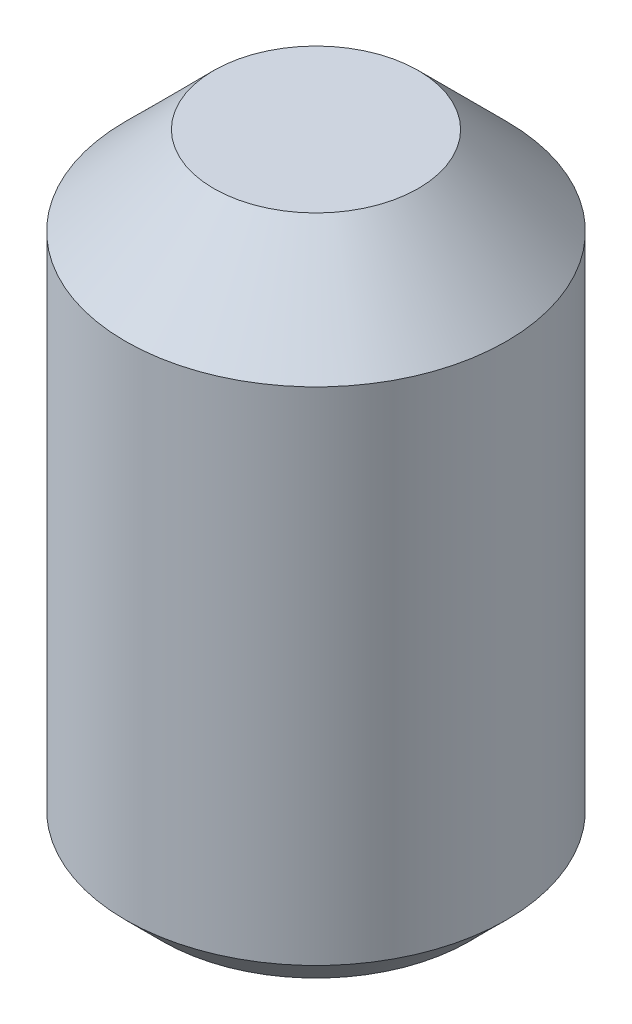
ISO-10303-21;
HEADER;
FILE_DESCRIPTION(('STEP AP214'),'2;1');
FILE_NAME('part.step','',(''),(''),'','','');
FILE_SCHEMA(('AUTOMOTIVE_DESIGN { 1 0 10303 214 1 1 1 1 }'));
ENDSEC;
DATA;
#1=APPLICATION_CONTEXT('core data for automotive mechanical design processes');
#2=APPLICATION_PROTOCOL_DEFINITION('international standard','automotive_design',2000,#1);
#3=PRODUCT_CONTEXT('',#1,'mechanical');
#4=PRODUCT('Part','Part','',(#3));
#5=PRODUCT_RELATED_PRODUCT_CATEGORY('part','',(#4));
#6=PRODUCT_DEFINITION_FORMATION('','',#4);
#7=PRODUCT_DEFINITION_CONTEXT('part definition',#1,'design');
#8=PRODUCT_DEFINITION('design','',#6,#7);
#9=PRODUCT_DEFINITION_SHAPE('','',#8);
#10=(LENGTH_UNIT() NAMED_UNIT(*) SI_UNIT(.MILLI.,.METRE.));
#11=(NAMED_UNIT(*) PLANE_ANGLE_UNIT() SI_UNIT($,.RADIAN.));
#12=(NAMED_UNIT(*) SI_UNIT($,.STERADIAN.) SOLID_ANGLE_UNIT());
#13=UNCERTAINTY_MEASURE_WITH_UNIT(LENGTH_MEASURE(1.E-05),#10,'distance_accuracy_value','');
#14=(GEOMETRIC_REPRESENTATION_CONTEXT(3) GLOBAL_UNCERTAINTY_ASSIGNED_CONTEXT((#13)) GLOBAL_UNIT_ASSIGNED_CONTEXT((#10,
#11,#12)) REPRESENTATION_CONTEXT('',''));
#15=CARTESIAN_POINT('',(0.,0.,0.));
#16=DIRECTION('',(0.,0.,1.));
#17=DIRECTION('',(1.,0.,0.));
#18=AXIS2_PLACEMENT_3D('',#15,#16,#17);
#19=CARTESIAN_POINT('',(0.68704079,0.,1.18998955515226));
#20=DIRECTION('',(0.,0.,1.));
#21=DIRECTION('',(1.,0.,0.));
#22=AXIS2_PLACEMENT_3D('',#19,#20,#21);
#23=PLANE('',#22);
#24=DIRECTION('',(0.,1.,0.));
#25=VECTOR('',#24,1.);
#26=CARTESIAN_POINT('',(-0.68704079,0.,1.18998955515226));
#27=LINE('',#26,#25);
#28=CARTESIAN_POINT('',(-0.68704079,0.,1.18998955515226));
#29=VERTEX_POINT('',#28);
#30=CARTESIAN_POINT('',(-0.68704079,2.54,1.18998955515226));
#31=VERTEX_POINT('',#30);
#32=EDGE_CURVE('E82',#29,#31,#27,.T.);
#33=ORIENTED_EDGE('',*,*,#32,.T.);
#34=DIRECTION('',(1.,0.,0.));
#35=VECTOR('',#34,1.);
#36=CARTESIAN_POINT('',(0.68704079,2.54,1.18998955515226));
#37=LINE('',#36,#35);
#38=CARTESIAN_POINT('',(0.68704079,2.54,1.18998955515226));
#39=VERTEX_POINT('',#38);
#40=EDGE_CURVE('E71',#39,#31,#37,.F.);
#41=ORIENTED_EDGE('',*,*,#40,.F.);
#42=DIRECTION('',(0.,1.,0.));
#43=VECTOR('',#42,1.);
#44=CARTESIAN_POINT('',(0.68704079,0.,1.18998955515226));
#45=LINE('',#44,#43);
#46=CARTESIAN_POINT('',(0.68704079,0.,1.18998955515226));
#47=VERTEX_POINT('',#46);
#48=EDGE_CURVE('E90',#39,#47,#45,.F.);
#49=ORIENTED_EDGE('',*,*,#48,.T.);
#50=DIRECTION('',(1.,0.,0.));
#51=VECTOR('',#50,1.);
#52=CARTESIAN_POINT('',(0.68704079,0.,1.18998955515226));
#53=LINE('',#52,#51);
#54=EDGE_CURVE('E66',#29,#47,#53,.T.);
#55=ORIENTED_EDGE('',*,*,#54,.F.);
#56=EDGE_LOOP('',(#33,#41,#49,#55));
#57=FACE_BOUND('',#56,.T.);
#58=ADVANCED_FACE('F16',(#57),#23,.F.);
#59=CARTESIAN_POINT('',(-0.68704079,0.,1.18998955515226));
#60=DIRECTION('',(-0.866025403784439,0.,0.5));
#61=DIRECTION('',(0.5,0.,0.866025403784439));
#62=AXIS2_PLACEMENT_3D('',#59,#60,#61);
#63=PLANE('',#62);
#64=DIRECTION('',(0.,1.,0.));
#65=VECTOR('',#64,1.);
#66=CARTESIAN_POINT('',(-1.37408158,0.,0.));
#67=LINE('',#66,#65);
#68=CARTESIAN_POINT('',(-1.37408158,0.,0.));
#69=VERTEX_POINT('',#68);
#70=CARTESIAN_POINT('',(-1.37408158,2.54,0.));
#71=VERTEX_POINT('',#70);
#72=EDGE_CURVE('E86',#69,#71,#67,.T.);
#73=ORIENTED_EDGE('',*,*,#72,.T.);
#74=DIRECTION('',(0.5,0.,0.866025403784439));
#75=VECTOR('',#74,1.);
#76=CARTESIAN_POINT('',(-0.68704079,2.54,1.18998955515226));
#77=LINE('',#76,#75);
#78=EDGE_CURVE('E75',#31,#71,#77,.F.);
#79=ORIENTED_EDGE('',*,*,#78,.F.);
#80=ORIENTED_EDGE('',*,*,#32,.F.);
#81=DIRECTION('',(0.5,0.,0.866025403784439));
#82=VECTOR('',#81,1.);
#83=CARTESIAN_POINT('',(-0.68704079,0.,1.18998955515226));
#84=LINE('',#83,#82);
#85=EDGE_CURVE('E88',#69,#29,#84,.T.);
#86=ORIENTED_EDGE('',*,*,#85,.F.);
#87=EDGE_LOOP('',(#73,#79,#80,#86));
#88=FACE_BOUND('',#87,.T.);
#89=ADVANCED_FACE('F85',(#88),#63,.F.);
#90=CARTESIAN_POINT('',(1.37408158,0.,0.));
#91=DIRECTION('',(0.866025403784439,0.,0.5));
#92=DIRECTION('',(0.5,0.,-0.866025403784439));
#93=AXIS2_PLACEMENT_3D('',#90,#91,#92);
#94=PLANE('',#93);
#95=ORIENTED_EDGE('',*,*,#48,.F.);
#96=DIRECTION('',(-0.5,0.,0.866025403784439));
#97=VECTOR('',#96,1.);
#98=CARTESIAN_POINT('',(1.37408158,2.54,0.));
#99=LINE('',#98,#97);
#100=CARTESIAN_POINT('',(1.37408158,2.54,0.));
#101=VERTEX_POINT('',#100);
#102=EDGE_CURVE('E78',#101,#39,#99,.T.);
#103=ORIENTED_EDGE('',*,*,#102,.F.);
#104=DIRECTION('',(0.,1.,0.));
#105=VECTOR('',#104,1.);
#106=CARTESIAN_POINT('',(1.37408158,0.,0.));
#107=LINE('',#106,#105);
#108=CARTESIAN_POINT('',(1.37408158,0.,0.));
#109=VERTEX_POINT('',#108);
#110=EDGE_CURVE('E121',#101,#109,#107,.F.);
#111=ORIENTED_EDGE('',*,*,#110,.T.);
#112=DIRECTION('',(0.5,0.,-0.866025403784439));
#113=VECTOR('',#112,1.);
#114=CARTESIAN_POINT('',(1.37408158,0.,0.));
#115=LINE('',#114,#113);
#116=EDGE_CURVE('E131',#47,#109,#115,.T.);
#117=ORIENTED_EDGE('',*,*,#116,.F.);
#118=EDGE_LOOP('',(#95,#103,#111,#117));
#119=FACE_BOUND('',#118,.T.);
#120=ADVANCED_FACE('F134',(#119),#94,.F.);
#121=CARTESIAN_POINT('',(-1.37408158,0.,0.));
#122=DIRECTION('',(-0.866025403784439,0.,-0.5));
#123=DIRECTION('',(-0.5,0.,0.866025403784439));
#124=AXIS2_PLACEMENT_3D('',#121,#122,#123);
#125=PLANE('',#124);
#126=DIRECTION('',(0.,1.,0.));
#127=VECTOR('',#126,1.);
#128=CARTESIAN_POINT('',(-0.68704079,0.,-1.18998955515226));
#129=LINE('',#128,#127);
#130=CARTESIAN_POINT('',(-0.68704079,0.,-1.18998955515226));
#131=VERTEX_POINT('',#130);
#132=CARTESIAN_POINT('',(-0.68704079,2.54,-1.18998955515226));
#133=VERTEX_POINT('',#132);
#134=EDGE_CURVE('E117',#131,#133,#129,.T.);
#135=ORIENTED_EDGE('',*,*,#134,.T.);
#136=DIRECTION('',(0.5,0.,-0.866025403784439));
#137=VECTOR('',#136,1.);
#138=CARTESIAN_POINT('',(-1.37408158,2.54,0.));
#139=LINE('',#138,#137);
#140=EDGE_CURVE('E126',#71,#133,#139,.T.);
#141=ORIENTED_EDGE('',*,*,#140,.F.);
#142=ORIENTED_EDGE('',*,*,#72,.F.);
#143=DIRECTION('',(-0.5,0.,0.866025403784439));
#144=VECTOR('',#143,1.);
#145=CARTESIAN_POINT('',(-1.37408158,0.,0.));
#146=LINE('',#145,#144);
#147=EDGE_CURVE('E34',#131,#69,#146,.T.);
#148=ORIENTED_EDGE('',*,*,#147,.F.);
#149=EDGE_LOOP('',(#135,#141,#142,#148));
#150=FACE_BOUND('',#149,.T.);
#151=ADVANCED_FACE('F140',(#150),#125,.F.);
#152=CARTESIAN_POINT('',(0.,2.54,0.));
#153=DIRECTION('',(0.,-1.,0.));
#154=DIRECTION('',(0.,0.,-1.));
#155=AXIS2_PLACEMENT_3D('',#152,#153,#154);
#156=PLANE('',#155);
#157=ORIENTED_EDGE('',*,*,#78,.T.);
#158=ORIENTED_EDGE('',*,*,#140,.T.);
#159=DIRECTION('',(-1.,0.,0.));
#160=VECTOR('',#159,1.);
#161=CARTESIAN_POINT('',(-0.68704079,2.54,-1.18998955515226));
#162=LINE('',#161,#160);
#163=CARTESIAN_POINT('',(0.68704079,2.54,-1.18998955515226));
#164=VERTEX_POINT('',#163);
#165=EDGE_CURVE('E111',#133,#164,#162,.F.);
#166=ORIENTED_EDGE('',*,*,#165,.T.);
#167=DIRECTION('',(-0.5,0.,-0.866025403784439));
#168=VECTOR('',#167,1.);
#169=CARTESIAN_POINT('',(0.68704079,2.54,-1.18998955515226));
#170=LINE('',#169,#168);
#171=EDGE_CURVE('E124',#164,#101,#170,.F.);
#172=ORIENTED_EDGE('',*,*,#171,.T.);
#173=ORIENTED_EDGE('',*,*,#102,.T.);
#174=ORIENTED_EDGE('',*,*,#40,.T.);
#175=EDGE_LOOP('',(#157,#158,#166,#172,#173,#174));
#176=FACE_BOUND('',#175,.T.);
#177=ADVANCED_FACE('F72',(#176),#156,.T.);
#178=CARTESIAN_POINT('',(0.68704079,0.,-1.18998955515226));
#179=DIRECTION('',(0.866025403784439,0.,-0.5));
#180=DIRECTION('',(-0.5,0.,-0.866025403784439));
#181=AXIS2_PLACEMENT_3D('',#178,#179,#180);
#182=PLANE('',#181);
#183=ORIENTED_EDGE('',*,*,#110,.F.);
#184=ORIENTED_EDGE('',*,*,#171,.F.);
#185=DIRECTION('',(0.,1.,0.));
#186=VECTOR('',#185,1.);
#187=CARTESIAN_POINT('',(0.68704079,0.,-1.18998955515226));
#188=LINE('',#187,#186);
#189=CARTESIAN_POINT('',(0.68704079,0.,-1.18998955515226));
#190=VERTEX_POINT('',#189);
#191=EDGE_CURVE('E105',#164,#190,#188,.F.);
#192=ORIENTED_EDGE('',*,*,#191,.T.);
#193=DIRECTION('',(-0.5,0.,-0.866025403784439));
#194=VECTOR('',#193,1.);
#195=CARTESIAN_POINT('',(0.68704079,0.,-1.18998955515226));
#196=LINE('',#195,#194);
#197=EDGE_CURVE('E119',#109,#190,#196,.T.);
#198=ORIENTED_EDGE('',*,*,#197,.F.);
#199=EDGE_LOOP('',(#183,#184,#192,#198));
#200=FACE_BOUND('',#199,.T.);
#201=ADVANCED_FACE('F145',(#200),#182,.F.);
#202=CARTESIAN_POINT('',(-0.68704079,0.,-1.18998955515226));
#203=DIRECTION('',(0.,0.,-1.));
#204=DIRECTION('',(-1.,0.,0.));
#205=AXIS2_PLACEMENT_3D('',#202,#203,#204);
#206=PLANE('',#205);
#207=ORIENTED_EDGE('',*,*,#191,.F.);
#208=ORIENTED_EDGE('',*,*,#165,.F.);
#209=ORIENTED_EDGE('',*,*,#134,.F.);
#210=DIRECTION('',(1.,0.,0.));
#211=VECTOR('',#210,1.);
#212=CARTESIAN_POINT('',(0.,0.,-1.18998955515226));
#213=LINE('',#212,#211);
#214=EDGE_CURVE('E101',#131,#190,#213,.T.);
#215=ORIENTED_EDGE('',*,*,#214,.T.);
#216=EDGE_LOOP('',(#207,#208,#209,#215));
#217=FACE_BOUND('',#216,.T.);
#218=ADVANCED_FACE('F143',(#217),#206,.F.);
#219=CARTESIAN_POINT('',(0.,0.,0.));
#220=DIRECTION('',(0.,1.,0.));
#221=DIRECTION('',(0.,0.,1.));
#222=AXIS2_PLACEMENT_3D('',#219,#220,#221);
#223=PLANE('',#222);
#224=ORIENTED_EDGE('',*,*,#147,.T.);
#225=ORIENTED_EDGE('',*,*,#85,.T.);
#226=ORIENTED_EDGE('',*,*,#54,.T.);
#227=ORIENTED_EDGE('',*,*,#116,.T.);
#228=ORIENTED_EDGE('',*,*,#197,.T.);
#229=ORIENTED_EDGE('',*,*,#214,.F.);
#230=EDGE_LOOP('',(#224,#225,#226,#227,#228,#229));
#231=FACE_BOUND('',#230,.T.);
#232=CARTESIAN_POINT('',(0.,0.,0.));
#233=DIRECTION('',(0.,1.,0.));
#234=DIRECTION('',(0.,0.,1.));
#235=AXIS2_PLACEMENT_3D('',#232,#233,#234);
#236=CIRCLE('',#235,1.94055999992315);
#237=CARTESIAN_POINT('',(0.,0.,1.94055999992315));
#238=VERTEX_POINT('',#237);
#239=EDGE_CURVE('E19',#238,#238,#236,.T.);
#240=ORIENTED_EDGE('',*,*,#239,.F.);
#241=EDGE_LOOP('',(#240));
#242=FACE_BOUND('',#241,.T.);
#243=ADVANCED_FACE('F138',(#231,#242),#223,.F.);
#244=CARTESIAN_POINT('',(0.,7.9375,0.));
#245=DIRECTION('',(0.,1.,0.));
#246=DIRECTION('',(0.,0.,1.));
#247=AXIS2_PLACEMENT_3D('',#244,#245,#246);
#248=PLANE('',#247);
#249=CARTESIAN_POINT('',(0.,7.93749999991178,0.));
#250=DIRECTION('',(0.,-1.,0.));
#251=DIRECTION('',(0.,0.,-1.));
#252=AXIS2_PLACEMENT_3D('',#249,#250,#251);
#253=CIRCLE('',#252,1.29540000000361);
#254=CARTESIAN_POINT('',(0.,7.93749999991178,-1.29540000000361));
#255=VERTEX_POINT('',#254);
#256=EDGE_CURVE('E94',#255,#255,#253,.T.);
#257=ORIENTED_EDGE('',*,*,#256,.F.);
#258=EDGE_LOOP('',(#257));
#259=FACE_BOUND('',#258,.T.);
#260=ADVANCED_FACE('F170',(#259),#248,.T.);
#261=CARTESIAN_POINT('',(0.,0.472440000066854,0.));
#262=DIRECTION('',(0.,1.,0.));
#263=DIRECTION('',(0.,0.,1.));
#264=AXIS2_PLACEMENT_3D('',#261,#262,#263);
#265=CONICAL_SURFACE('',#264,2.41299999999001,0.785398163397449);
#266=CARTESIAN_POINT('',(0.,0.47244,0.));
#267=DIRECTION('',(0.,1.,0.));
#268=DIRECTION('',(0.,0.,1.));
#269=AXIS2_PLACEMENT_3D('',#266,#267,#268);
#270=CIRCLE('',#269,2.413);
#271=CARTESIAN_POINT('',(0.,0.47244,2.413));
#272=VERTEX_POINT('',#271);
#273=EDGE_CURVE('E25',#272,#272,#270,.T.);
#274=ORIENTED_EDGE('',*,*,#273,.F.);
#275=EDGE_LOOP('',(#274));
#276=FACE_BOUND('',#275,.T.);
#277=ORIENTED_EDGE('',*,*,#239,.T.);
#278=EDGE_LOOP('',(#277));
#279=FACE_BOUND('',#278,.T.);
#280=ADVANCED_FACE('F163',(#276,#279),#265,.T.);
#281=CARTESIAN_POINT('',(0.,6.81989999998223,0.));
#282=DIRECTION('',(0.,-1.,0.));
#283=DIRECTION('',(0.,0.,-1.));
#284=AXIS2_PLACEMENT_3D('',#281,#282,#283);
#285=CONICAL_SURFACE('',#284,2.41299999993316,0.785398163397448);
#286=CARTESIAN_POINT('',(0.,6.8199,0.));
#287=DIRECTION('',(0.,1.,0.));
#288=DIRECTION('',(0.,0.,1.));
#289=AXIS2_PLACEMENT_3D('',#286,#287,#288);
#290=CIRCLE('',#289,2.413);
#291=CARTESIAN_POINT('',(0.,6.8199,2.413));
#292=VERTEX_POINT('',#291);
#293=EDGE_CURVE('E11',#292,#292,#290,.F.);
#294=ORIENTED_EDGE('',*,*,#293,.F.);
#295=EDGE_LOOP('',(#294));
#296=FACE_BOUND('',#295,.T.);
#297=ORIENTED_EDGE('',*,*,#256,.T.);
#298=EDGE_LOOP('',(#297));
#299=FACE_BOUND('',#298,.T.);
#300=ADVANCED_FACE('F157',(#296,#299),#285,.T.);
#301=CARTESIAN_POINT('',(0.,0.,0.));
#302=DIRECTION('',(0.,1.,0.));
#303=DIRECTION('',(0.,0.,1.));
#304=AXIS2_PLACEMENT_3D('',#301,#302,#303);
#305=CYLINDRICAL_SURFACE('',#304,2.413);
#306=ORIENTED_EDGE('',*,*,#293,.T.);
#307=EDGE_LOOP('',(#306));
#308=FACE_BOUND('',#307,.T.);
#309=ORIENTED_EDGE('',*,*,#273,.T.);
#310=EDGE_LOOP('',(#309));
#311=FACE_BOUND('',#310,.T.);
#312=ADVANCED_FACE('F155',(#308,#311),#305,.T.);
#313=CLOSED_SHELL('',(#58,#89,#120,#151,#177,#201,#218,#243,#260,#280,#300,#312));
#314=MANIFOLD_SOLID_BREP('B1',#313);
#315=ADVANCED_BREP_SHAPE_REPRESENTATION('',(#18,#314),#14);
#316=SHAPE_DEFINITION_REPRESENTATION(#9,#315);
ENDSEC;
END-ISO-10303-21;
